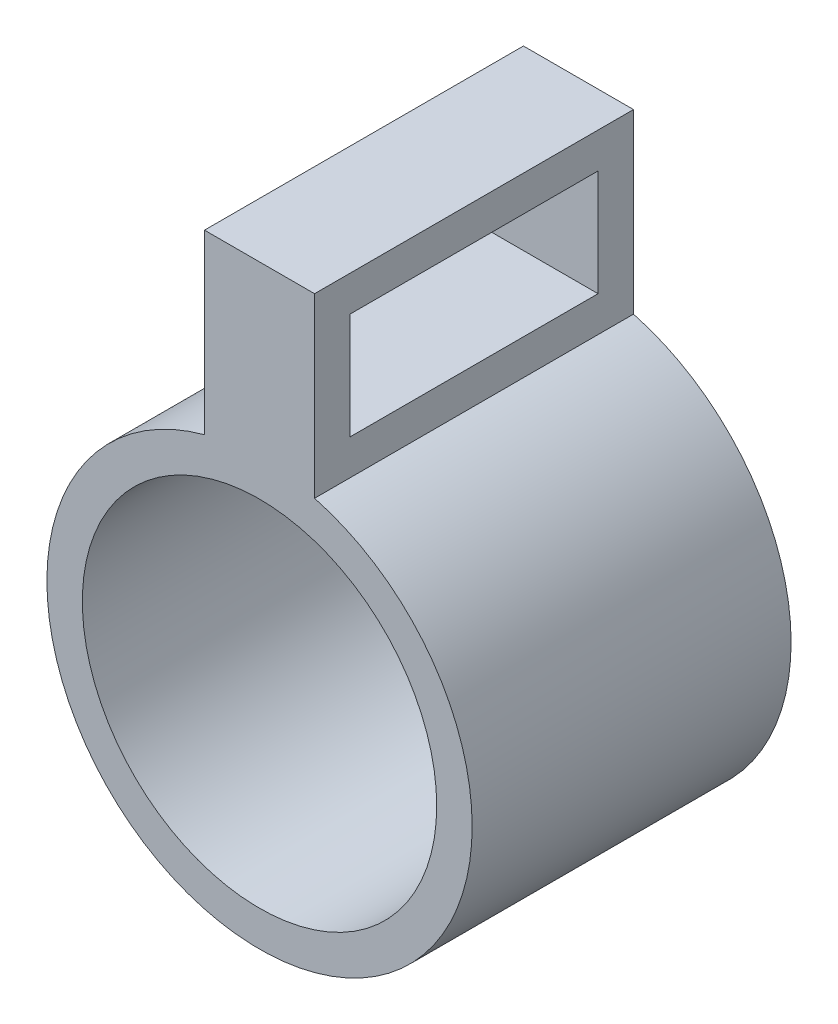
ISO-10303-21;
HEADER;
FILE_DESCRIPTION(('STEP AP214'),'2;1');
FILE_NAME('part.step','',(''),(''),'','','');
FILE_SCHEMA(('AUTOMOTIVE_DESIGN { 1 0 10303 214 1 1 1 1 }'));
ENDSEC;
DATA;
#1=APPLICATION_CONTEXT('core data for automotive mechanical design processes');
#2=APPLICATION_PROTOCOL_DEFINITION('international standard','automotive_design',2000,#1);
#3=PRODUCT_CONTEXT('',#1,'mechanical');
#4=PRODUCT('Part','Part','',(#3));
#5=PRODUCT_RELATED_PRODUCT_CATEGORY('part','',(#4));
#6=PRODUCT_DEFINITION_FORMATION('','',#4);
#7=PRODUCT_DEFINITION_CONTEXT('part definition',#1,'design');
#8=PRODUCT_DEFINITION('design','',#6,#7);
#9=PRODUCT_DEFINITION_SHAPE('','',#8);
#10=(LENGTH_UNIT() NAMED_UNIT(*) SI_UNIT(.MILLI.,.METRE.));
#11=(NAMED_UNIT(*) PLANE_ANGLE_UNIT() SI_UNIT($,.RADIAN.));
#12=(NAMED_UNIT(*) SI_UNIT($,.STERADIAN.) SOLID_ANGLE_UNIT());
#13=UNCERTAINTY_MEASURE_WITH_UNIT(LENGTH_MEASURE(1.E-05),#10,'distance_accuracy_value','');
#14=(GEOMETRIC_REPRESENTATION_CONTEXT(3) GLOBAL_UNCERTAINTY_ASSIGNED_CONTEXT((#13)) GLOBAL_UNIT_ASSIGNED_CONTEXT((#10,
#11,#12)) REPRESENTATION_CONTEXT('',''));
#15=CARTESIAN_POINT('',(0.,0.,0.));
#16=DIRECTION('',(0.,0.,1.));
#17=DIRECTION('',(1.,0.,0.));
#18=AXIS2_PLACEMENT_3D('',#15,#16,#17);
#19=CARTESIAN_POINT('',(0.,0.,16.));
#20=DIRECTION('',(0.,0.,1.));
#21=DIRECTION('',(1.,0.,0.));
#22=AXIS2_PLACEMENT_3D('',#19,#20,#21);
#23=PLANE('',#22);
#24=DIRECTION('',(-1.,0.,0.));
#25=VECTOR('',#24,1.);
#26=CARTESIAN_POINT('',(-3.10582854123034,21.5911099154688,16.));
#27=LINE('',#26,#25);
#28=CARTESIAN_POINT('',(3.10582854123034,21.5911099154688,16.));
#29=VERTEX_POINT('',#28);
#30=CARTESIAN_POINT('',(-3.10582854123034,21.5911099154688,16.));
#31=VERTEX_POINT('',#30);
#32=EDGE_CURVE('E150',#29,#31,#27,.T.);
#33=ORIENTED_EDGE('',*,*,#32,.T.);
#34=DIRECTION('',(0.,-1.,0.));
#35=VECTOR('',#34,1.);
#36=CARTESIAN_POINT('',(-3.10582854123018,11.5911099154688,16.));
#37=LINE('',#36,#35);
#38=CARTESIAN_POINT('',(-3.10582854123018,11.5911099154688,16.));
#39=VERTEX_POINT('',#38);
#40=EDGE_CURVE('E155',#31,#39,#37,.T.);
#41=ORIENTED_EDGE('',*,*,#40,.T.);
#42=CARTESIAN_POINT('',(0.,0.,16.));
#43=DIRECTION('',(0.,0.,1.));
#44=DIRECTION('',(1.,0.,0.));
#45=AXIS2_PLACEMENT_3D('',#42,#43,#44);
#46=CIRCLE('',#45,12.);
#47=CARTESIAN_POINT('',(3.10582854123034,11.5911099154688,16.));
#48=VERTEX_POINT('',#47);
#49=EDGE_CURVE('E157',#39,#48,#46,.T.);
#50=ORIENTED_EDGE('',*,*,#49,.T.);
#51=DIRECTION('',(0.,1.,0.));
#52=VECTOR('',#51,1.);
#53=CARTESIAN_POINT('',(3.10582854123034,11.5911099154688,16.));
#54=LINE('',#53,#52);
#55=EDGE_CURVE('E159',#48,#29,#54,.T.);
#56=ORIENTED_EDGE('',*,*,#55,.T.);
#57=EDGE_LOOP('',(#33,#41,#50,#56));
#58=FACE_BOUND('',#57,.T.);
#59=CARTESIAN_POINT('',(0.,0.,16.));
#60=DIRECTION('',(0.,0.,1.));
#61=DIRECTION('',(1.,0.,0.));
#62=AXIS2_PLACEMENT_3D('',#59,#60,#61);
#63=CIRCLE('',#62,10.);
#64=CARTESIAN_POINT('',(10.,0.,16.));
#65=VERTEX_POINT('',#64);
#66=EDGE_CURVE('E147',#65,#65,#63,.T.);
#67=ORIENTED_EDGE('',*,*,#66,.F.);
#68=EDGE_LOOP('',(#67));
#69=FACE_BOUND('',#68,.T.);
#70=ADVANCED_FACE('F39',(#58,#69),#23,.T.);
#71=CARTESIAN_POINT('',(-3.10582854123034,21.5911099154688,16.));
#72=DIRECTION('',(0.,-1.,0.));
#73=DIRECTION('',(0.,0.,-1.));
#74=AXIS2_PLACEMENT_3D('',#71,#72,#73);
#75=PLANE('',#74);
#76=DIRECTION('',(0.,0.,-1.));
#77=VECTOR('',#76,1.);
#78=CARTESIAN_POINT('',(3.10582854123034,21.5911099154688,16.));
#79=LINE('',#78,#77);
#80=CARTESIAN_POINT('',(3.10582854123034,21.5911099154688,-2.));
#81=VERTEX_POINT('',#80);
#82=EDGE_CURVE('E161',#29,#81,#79,.T.);
#83=ORIENTED_EDGE('',*,*,#82,.T.);
#84=DIRECTION('',(1.,0.,0.));
#85=VECTOR('',#84,1.);
#86=CARTESIAN_POINT('',(-3.10582854123034,21.5911099154688,-2.));
#87=LINE('',#86,#85);
#88=CARTESIAN_POINT('',(-3.10582854123034,21.5911099154688,-2.));
#89=VERTEX_POINT('',#88);
#90=EDGE_CURVE('E137',#89,#81,#87,.T.);
#91=ORIENTED_EDGE('',*,*,#90,.F.);
#92=DIRECTION('',(0.,0.,-1.));
#93=VECTOR('',#92,1.);
#94=CARTESIAN_POINT('',(-3.10582854123034,21.5911099154688,16.));
#95=LINE('',#94,#93);
#96=EDGE_CURVE('E11',#31,#89,#95,.T.);
#97=ORIENTED_EDGE('',*,*,#96,.F.);
#98=ORIENTED_EDGE('',*,*,#32,.F.);
#99=EDGE_LOOP('',(#83,#91,#97,#98));
#100=FACE_BOUND('',#99,.T.);
#101=ADVANCED_FACE('F41',(#100),#75,.F.);
#102=CARTESIAN_POINT('',(-3.10582854123018,11.5911099154688,16.));
#103=DIRECTION('',(1.,0.,0.));
#104=DIRECTION('',(0.,1.,0.));
#105=AXIS2_PLACEMENT_3D('',#102,#103,#104);
#106=PLANE('',#105);
#107=DIRECTION('',(0.,0.,-1.));
#108=VECTOR('',#107,1.);
#109=CARTESIAN_POINT('',(-3.10582854123031,19.5911099154688,0.));
#110=LINE('',#109,#108);
#111=CARTESIAN_POINT('',(-3.10582854123031,19.5911099154688,14.));
#112=VERTEX_POINT('',#111);
#113=CARTESIAN_POINT('',(-3.10582854123031,19.5911099154688,0.));
#114=VERTEX_POINT('',#113);
#115=EDGE_CURVE('E214',#112,#114,#110,.T.);
#116=ORIENTED_EDGE('',*,*,#115,.F.);
#117=DIRECTION('',(0.,1.,0.));
#118=VECTOR('',#117,1.);
#119=CARTESIAN_POINT('',(-3.10582854123031,19.591109915469,14.));
#120=LINE('',#119,#118);
#121=CARTESIAN_POINT('',(-3.10582854123021,13.5911099154688,14.));
#122=VERTEX_POINT('',#121);
#123=EDGE_CURVE('E134',#122,#112,#120,.T.);
#124=ORIENTED_EDGE('',*,*,#123,.F.);
#125=DIRECTION('',(0.,0.,1.));
#126=VECTOR('',#125,1.);
#127=CARTESIAN_POINT('',(-3.10582854123021,13.5911099154688,14.));
#128=LINE('',#127,#126);
#129=CARTESIAN_POINT('',(-3.10582854123021,13.5911099154688,0.));
#130=VERTEX_POINT('',#129);
#131=EDGE_CURVE('E131',#130,#122,#128,.T.);
#132=ORIENTED_EDGE('',*,*,#131,.F.);
#133=DIRECTION('',(0.,-1.,0.));
#134=VECTOR('',#133,1.);
#135=CARTESIAN_POINT('',(-3.10582854123021,13.591109915469,0.));
#136=LINE('',#135,#134);
#137=EDGE_CURVE('E109',#114,#130,#136,.T.);
#138=ORIENTED_EDGE('',*,*,#137,.F.);
#139=EDGE_LOOP('',(#116,#124,#132,#138));
#140=FACE_BOUND('',#139,.T.);
#141=ORIENTED_EDGE('',*,*,#96,.T.);
#142=DIRECTION('',(0.,1.,0.));
#143=VECTOR('',#142,1.);
#144=CARTESIAN_POINT('',(-3.10582854123017,11.5911099154688,-2.));
#145=LINE('',#144,#143);
#146=CARTESIAN_POINT('',(-3.10582854123016,11.5911099154688,-2.));
#147=VERTEX_POINT('',#146);
#148=EDGE_CURVE('E133',#147,#89,#145,.T.);
#149=ORIENTED_EDGE('',*,*,#148,.F.);
#150=DIRECTION('',(0.,0.,-1.));
#151=VECTOR('',#150,1.);
#152=CARTESIAN_POINT('',(-3.10582854123018,11.5911099154688,16.));
#153=LINE('',#152,#151);
#154=EDGE_CURVE('E47',#39,#147,#153,.T.);
#155=ORIENTED_EDGE('',*,*,#154,.F.);
#156=ORIENTED_EDGE('',*,*,#40,.F.);
#157=EDGE_LOOP('',(#141,#149,#155,#156));
#158=FACE_BOUND('',#157,.T.);
#159=ADVANCED_FACE('F175',(#140,#158),#106,.F.);
#160=CARTESIAN_POINT('',(0.,0.,16.));
#161=DIRECTION('',(0.,0.,-1.));
#162=DIRECTION('',(-1.,0.,0.));
#163=AXIS2_PLACEMENT_3D('',#160,#161,#162);
#164=CYLINDRICAL_SURFACE('',#163,12.);
#165=ORIENTED_EDGE('',*,*,#154,.T.);
#166=CARTESIAN_POINT('',(0.,0.,-2.));
#167=DIRECTION('',(0.,0.,-1.));
#168=DIRECTION('',(-1.,0.,0.));
#169=AXIS2_PLACEMENT_3D('',#166,#167,#168);
#170=CIRCLE('',#169,12.);
#171=CARTESIAN_POINT('',(3.10582854123034,11.5911099154688,-2.));
#172=VERTEX_POINT('',#171);
#173=EDGE_CURVE('E143',#172,#147,#170,.T.);
#174=ORIENTED_EDGE('',*,*,#173,.F.);
#175=DIRECTION('',(0.,0.,-1.));
#176=VECTOR('',#175,1.);
#177=CARTESIAN_POINT('',(3.10582854123034,11.5911099154688,16.));
#178=LINE('',#177,#176);
#179=EDGE_CURVE('E163',#48,#172,#178,.T.);
#180=ORIENTED_EDGE('',*,*,#179,.F.);
#181=ORIENTED_EDGE('',*,*,#49,.F.);
#182=EDGE_LOOP('',(#165,#174,#180,#181));
#183=FACE_BOUND('',#182,.T.);
#184=ADVANCED_FACE('F168',(#183),#164,.T.);
#185=CARTESIAN_POINT('',(3.10582854123034,11.5911099154688,16.));
#186=DIRECTION('',(-1.,0.,0.));
#187=DIRECTION('',(0.,-1.,0.));
#188=AXIS2_PLACEMENT_3D('',#185,#186,#187);
#189=PLANE('',#188);
#190=DIRECTION('',(0.,0.,-1.));
#191=VECTOR('',#190,1.);
#192=CARTESIAN_POINT('',(3.10582854123034,13.5911099154688,14.));
#193=LINE('',#192,#191);
#194=CARTESIAN_POINT('',(3.10582854123034,13.5911099154688,14.));
#195=VERTEX_POINT('',#194);
#196=CARTESIAN_POINT('',(3.10582854123034,13.5911099154688,0.));
#197=VERTEX_POINT('',#196);
#198=EDGE_CURVE('E115',#195,#197,#193,.T.);
#199=ORIENTED_EDGE('',*,*,#198,.F.);
#200=DIRECTION('',(0.,-1.,0.));
#201=VECTOR('',#200,1.);
#202=CARTESIAN_POINT('',(3.10582854123034,19.5911099154688,14.));
#203=LINE('',#202,#201);
#204=CARTESIAN_POINT('',(3.10582854123034,19.5911099154688,14.));
#205=VERTEX_POINT('',#204);
#206=EDGE_CURVE('E62',#205,#195,#203,.T.);
#207=ORIENTED_EDGE('',*,*,#206,.F.);
#208=DIRECTION('',(0.,0.,1.));
#209=VECTOR('',#208,1.);
#210=CARTESIAN_POINT('',(3.10582854123034,19.5911099154688,0.));
#211=LINE('',#210,#209);
#212=CARTESIAN_POINT('',(3.10582854123034,19.5911099154688,0.));
#213=VERTEX_POINT('',#212);
#214=EDGE_CURVE('E122',#213,#205,#211,.T.);
#215=ORIENTED_EDGE('',*,*,#214,.F.);
#216=DIRECTION('',(0.,1.,0.));
#217=VECTOR('',#216,1.);
#218=CARTESIAN_POINT('',(3.10582854123034,13.5911099154688,0.));
#219=LINE('',#218,#217);
#220=EDGE_CURVE('E106',#197,#213,#219,.T.);
#221=ORIENTED_EDGE('',*,*,#220,.F.);
#222=EDGE_LOOP('',(#199,#207,#215,#221));
#223=FACE_BOUND('',#222,.T.);
#224=ORIENTED_EDGE('',*,*,#179,.T.);
#225=DIRECTION('',(0.,-1.,0.));
#226=VECTOR('',#225,1.);
#227=CARTESIAN_POINT('',(3.10582854123034,21.5911099154688,-2.));
#228=LINE('',#227,#226);
#229=EDGE_CURVE('E140',#81,#172,#228,.T.);
#230=ORIENTED_EDGE('',*,*,#229,.F.);
#231=ORIENTED_EDGE('',*,*,#82,.F.);
#232=ORIENTED_EDGE('',*,*,#55,.F.);
#233=EDGE_LOOP('',(#224,#230,#231,#232));
#234=FACE_BOUND('',#233,.T.);
#235=ADVANCED_FACE('F119',(#223,#234),#189,.F.);
#236=CARTESIAN_POINT('',(0.,0.,16.));
#237=DIRECTION('',(0.,0.,-1.));
#238=DIRECTION('',(-1.,0.,0.));
#239=AXIS2_PLACEMENT_3D('',#236,#237,#238);
#240=CYLINDRICAL_SURFACE('',#239,10.);
#241=ORIENTED_EDGE('',*,*,#66,.T.);
#242=EDGE_LOOP('',(#241));
#243=FACE_BOUND('',#242,.T.);
#244=CARTESIAN_POINT('',(0.,0.,0.));
#245=DIRECTION('',(0.,0.,1.));
#246=DIRECTION('',(1.,0.,0.));
#247=AXIS2_PLACEMENT_3D('',#244,#245,#246);
#248=CIRCLE('',#247,10.);
#249=CARTESIAN_POINT('',(10.,0.,0.));
#250=VERTEX_POINT('',#249);
#251=EDGE_CURVE('E146',#250,#250,#248,.T.);
#252=ORIENTED_EDGE('',*,*,#251,.F.);
#253=EDGE_LOOP('',(#252));
#254=FACE_BOUND('',#253,.T.);
#255=ADVANCED_FACE('F188',(#243,#254),#240,.F.);
#256=CARTESIAN_POINT('',(0.,0.,0.));
#257=DIRECTION('',(0.,0.,-1.));
#258=DIRECTION('',(-1.,0.,0.));
#259=AXIS2_PLACEMENT_3D('',#256,#257,#258);
#260=PLANE('',#259);
#261=ORIENTED_EDGE('',*,*,#251,.T.);
#262=EDGE_LOOP('',(#261));
#263=FACE_BOUND('',#262,.T.);
#264=ADVANCED_FACE('F191',(#263),#260,.F.);
#265=CARTESIAN_POINT('',(0.,0.,-2.));
#266=DIRECTION('',(0.,0.,-1.));
#267=DIRECTION('',(-1.,0.,0.));
#268=AXIS2_PLACEMENT_3D('',#265,#266,#267);
#269=PLANE('',#268);
#270=ORIENTED_EDGE('',*,*,#148,.T.);
#271=ORIENTED_EDGE('',*,*,#90,.T.);
#272=ORIENTED_EDGE('',*,*,#229,.T.);
#273=ORIENTED_EDGE('',*,*,#173,.T.);
#274=EDGE_LOOP('',(#270,#271,#272,#273));
#275=FACE_BOUND('',#274,.T.);
#276=ADVANCED_FACE('F173',(#275),#269,.T.);
#277=CARTESIAN_POINT('',(-18.3373747529581,19.5911099154688,14.));
#278=DIRECTION('',(0.,0.,1.));
#279=DIRECTION('',(1.,0.,0.));
#280=AXIS2_PLACEMENT_3D('',#277,#278,#279);
#281=PLANE('',#280);
#282=ORIENTED_EDGE('',*,*,#123,.T.);
#283=DIRECTION('',(1.,0.,0.));
#284=VECTOR('',#283,1.);
#285=CARTESIAN_POINT('',(-18.3373747529581,19.5911099154688,14.));
#286=LINE('',#285,#284);
#287=EDGE_CURVE('E127',#112,#205,#286,.T.);
#288=ORIENTED_EDGE('',*,*,#287,.T.);
#289=ORIENTED_EDGE('',*,*,#206,.T.);
#290=DIRECTION('',(1.,0.,0.));
#291=VECTOR('',#290,1.);
#292=CARTESIAN_POINT('',(-18.3373747529581,13.5911099154688,14.));
#293=LINE('',#292,#291);
#294=EDGE_CURVE('E112',#122,#195,#293,.T.);
#295=ORIENTED_EDGE('',*,*,#294,.F.);
#296=EDGE_LOOP('',(#282,#288,#289,#295));
#297=FACE_BOUND('',#296,.T.);
#298=ADVANCED_FACE('F201',(#297),#281,.F.);
#299=CARTESIAN_POINT('',(-18.3373747529581,19.5911099154688,0.));
#300=DIRECTION('',(0.,1.,0.));
#301=DIRECTION('',(-1.,0.,0.));
#302=AXIS2_PLACEMENT_3D('',#299,#300,#301);
#303=PLANE('',#302);
#304=ORIENTED_EDGE('',*,*,#115,.T.);
#305=DIRECTION('',(1.,0.,0.));
#306=VECTOR('',#305,1.);
#307=CARTESIAN_POINT('',(-18.3373747529581,19.5911099154688,0.));
#308=LINE('',#307,#306);
#309=EDGE_CURVE('E111',#114,#213,#308,.T.);
#310=ORIENTED_EDGE('',*,*,#309,.T.);
#311=ORIENTED_EDGE('',*,*,#214,.T.);
#312=ORIENTED_EDGE('',*,*,#287,.F.);
#313=EDGE_LOOP('',(#304,#310,#311,#312));
#314=FACE_BOUND('',#313,.T.);
#315=ADVANCED_FACE('F220',(#314),#303,.F.);
#316=CARTESIAN_POINT('',(-18.3373747529581,13.5911099154688,0.));
#317=DIRECTION('',(0.,0.,-1.));
#318=DIRECTION('',(-1.,0.,0.));
#319=AXIS2_PLACEMENT_3D('',#316,#317,#318);
#320=PLANE('',#319);
#321=ORIENTED_EDGE('',*,*,#137,.T.);
#322=DIRECTION('',(1.,0.,0.));
#323=VECTOR('',#322,1.);
#324=CARTESIAN_POINT('',(-18.3373747529581,13.5911099154688,0.));
#325=LINE('',#324,#323);
#326=EDGE_CURVE('E54',#130,#197,#325,.T.);
#327=ORIENTED_EDGE('',*,*,#326,.T.);
#328=ORIENTED_EDGE('',*,*,#220,.T.);
#329=ORIENTED_EDGE('',*,*,#309,.F.);
#330=EDGE_LOOP('',(#321,#327,#328,#329));
#331=FACE_BOUND('',#330,.T.);
#332=ADVANCED_FACE('F103',(#331),#320,.F.);
#333=CARTESIAN_POINT('',(-18.3373747529581,13.5911099154688,14.));
#334=DIRECTION('',(0.,-1.,0.));
#335=DIRECTION('',(1.,0.,0.));
#336=AXIS2_PLACEMENT_3D('',#333,#334,#335);
#337=PLANE('',#336);
#338=ORIENTED_EDGE('',*,*,#131,.T.);
#339=ORIENTED_EDGE('',*,*,#294,.T.);
#340=ORIENTED_EDGE('',*,*,#198,.T.);
#341=ORIENTED_EDGE('',*,*,#326,.F.);
#342=EDGE_LOOP('',(#338,#339,#340,#341));
#343=FACE_BOUND('',#342,.T.);
#344=ADVANCED_FACE('F116',(#343),#337,.F.);
#345=CLOSED_SHELL('',(#70,#101,#159,#184,#235,#255,#264,#276,#298,#315,#332,#344));
#346=MANIFOLD_SOLID_BREP('B2',#345);
#347=ADVANCED_BREP_SHAPE_REPRESENTATION('',(#18,#346),#14);
#348=SHAPE_DEFINITION_REPRESENTATION(#9,#347);
ENDSEC;
END-ISO-10303-21;
